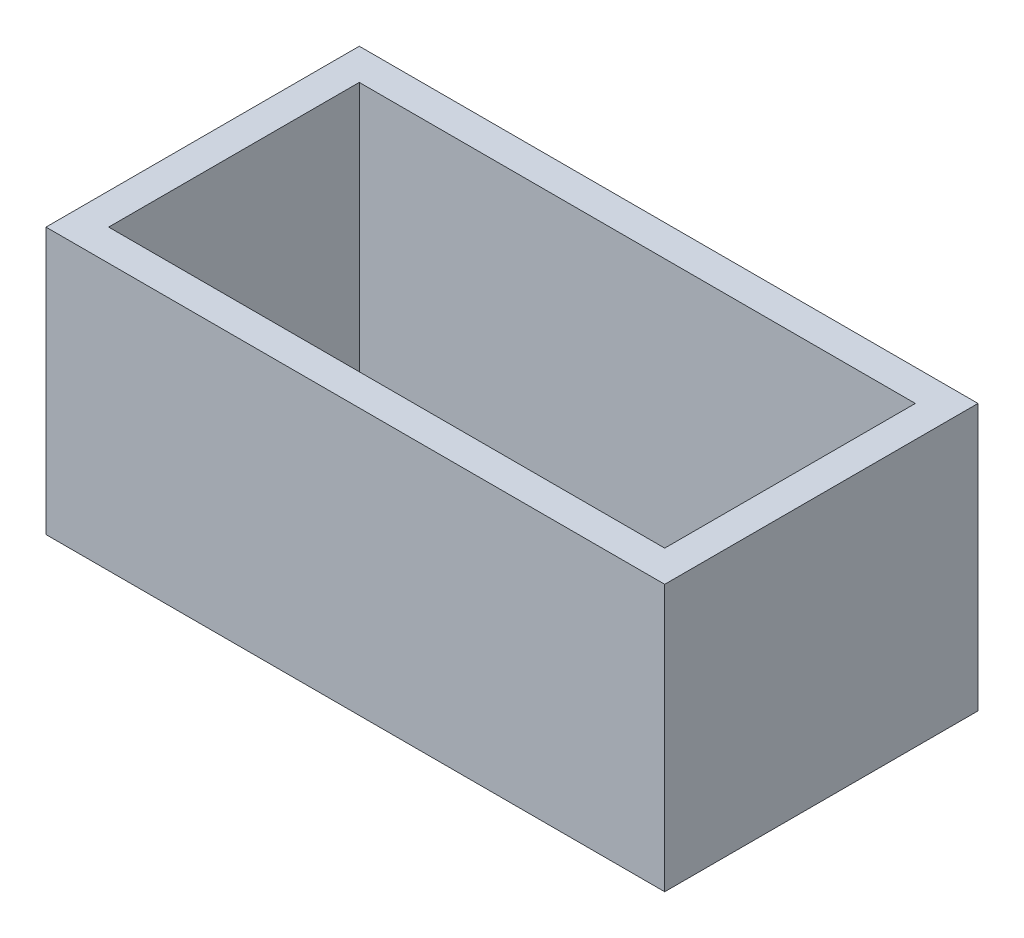
ISO-10303-21;
HEADER;
FILE_DESCRIPTION(('STEP AP214'),'2;1');
FILE_NAME('part.step','',(''),(''),'','','');
FILE_SCHEMA(('AUTOMOTIVE_DESIGN { 1 0 10303 214 1 1 1 1 }'));
ENDSEC;
DATA;
#1=APPLICATION_CONTEXT('core data for automotive mechanical design processes');
#2=APPLICATION_PROTOCOL_DEFINITION('international standard','automotive_design',2000,#1);
#3=PRODUCT_CONTEXT('',#1,'mechanical');
#4=PRODUCT('Part','Part','',(#3));
#5=PRODUCT_RELATED_PRODUCT_CATEGORY('part','',(#4));
#6=PRODUCT_DEFINITION_FORMATION('','',#4);
#7=PRODUCT_DEFINITION_CONTEXT('part definition',#1,'design');
#8=PRODUCT_DEFINITION('design','',#6,#7);
#9=PRODUCT_DEFINITION_SHAPE('','',#8);
#10=(LENGTH_UNIT() NAMED_UNIT(*) SI_UNIT(.MILLI.,.METRE.));
#11=(NAMED_UNIT(*) PLANE_ANGLE_UNIT() SI_UNIT($,.RADIAN.));
#12=(NAMED_UNIT(*) SI_UNIT($,.STERADIAN.) SOLID_ANGLE_UNIT());
#13=UNCERTAINTY_MEASURE_WITH_UNIT(LENGTH_MEASURE(1.E-05),#10,'distance_accuracy_value','');
#14=(GEOMETRIC_REPRESENTATION_CONTEXT(3) GLOBAL_UNCERTAINTY_ASSIGNED_CONTEXT((#13)) GLOBAL_UNIT_ASSIGNED_CONTEXT((#10,
#11,#12)) REPRESENTATION_CONTEXT('',''));
#15=CARTESIAN_POINT('',(0.,0.,0.));
#16=DIRECTION('',(0.,0.,1.));
#17=DIRECTION('',(1.,0.,0.));
#18=AXIS2_PLACEMENT_3D('',#15,#16,#17);
#19=CARTESIAN_POINT('',(0.,17.,0.));
#20=DIRECTION('',(0.,-1.,0.));
#21=DIRECTION('',(0.,0.,-1.));
#22=AXIS2_PLACEMENT_3D('',#19,#20,#21);
#23=PLANE('',#22);
#24=DIRECTION('',(1.,0.,0.));
#25=VECTOR('',#24,1.);
#26=CARTESIAN_POINT('',(19.75,17.,10.));
#27=LINE('',#26,#25);
#28=CARTESIAN_POINT('',(-19.75,17.,10.));
#29=VERTEX_POINT('',#28);
#30=CARTESIAN_POINT('',(19.75,17.,10.));
#31=VERTEX_POINT('',#30);
#32=EDGE_CURVE('E134',#29,#31,#27,.T.);
#33=ORIENTED_EDGE('',*,*,#32,.T.);
#34=DIRECTION('',(0.,0.,-1.));
#35=VECTOR('',#34,1.);
#36=CARTESIAN_POINT('',(19.75,17.,10.));
#37=LINE('',#36,#35);
#38=CARTESIAN_POINT('',(19.75,17.,-10.));
#39=VERTEX_POINT('',#38);
#40=EDGE_CURVE('E137',#31,#39,#37,.T.);
#41=ORIENTED_EDGE('',*,*,#40,.T.);
#42=DIRECTION('',(-1.,0.,0.));
#43=VECTOR('',#42,1.);
#44=CARTESIAN_POINT('',(19.75,17.,-10.));
#45=LINE('',#44,#43);
#46=CARTESIAN_POINT('',(-19.75,17.,-10.));
#47=VERTEX_POINT('',#46);
#48=EDGE_CURVE('E140',#39,#47,#45,.T.);
#49=ORIENTED_EDGE('',*,*,#48,.T.);
#50=DIRECTION('',(0.,0.,1.));
#51=VECTOR('',#50,1.);
#52=CARTESIAN_POINT('',(-19.75,17.,10.));
#53=LINE('',#52,#51);
#54=EDGE_CURVE('E142',#47,#29,#53,.T.);
#55=ORIENTED_EDGE('',*,*,#54,.T.);
#56=EDGE_LOOP('',(#33,#41,#49,#55));
#57=FACE_BOUND('',#56,.T.);
#58=DIRECTION('',(0.,0.,1.));
#59=VECTOR('',#58,1.);
#60=CARTESIAN_POINT('',(-17.75,17.,8.));
#61=LINE('',#60,#59);
#62=CARTESIAN_POINT('',(-17.75,17.,-8.));
#63=VERTEX_POINT('',#62);
#64=CARTESIAN_POINT('',(-17.75,17.,8.));
#65=VERTEX_POINT('',#64);
#66=EDGE_CURVE('E98',#63,#65,#61,.T.);
#67=ORIENTED_EDGE('',*,*,#66,.F.);
#68=DIRECTION('',(-1.,0.,0.));
#69=VECTOR('',#68,1.);
#70=CARTESIAN_POINT('',(17.75,17.,-8.));
#71=LINE('',#70,#69);
#72=CARTESIAN_POINT('',(17.75,17.,-8.));
#73=VERTEX_POINT('',#72);
#74=EDGE_CURVE('E120',#73,#63,#71,.T.);
#75=ORIENTED_EDGE('',*,*,#74,.F.);
#76=DIRECTION('',(0.,0.,-1.));
#77=VECTOR('',#76,1.);
#78=CARTESIAN_POINT('',(17.75,17.,8.));
#79=LINE('',#78,#77);
#80=CARTESIAN_POINT('',(17.75,17.,8.));
#81=VERTEX_POINT('',#80);
#82=EDGE_CURVE('E118',#81,#73,#79,.T.);
#83=ORIENTED_EDGE('',*,*,#82,.F.);
#84=DIRECTION('',(1.,0.,0.));
#85=VECTOR('',#84,1.);
#86=CARTESIAN_POINT('',(17.75,17.,8.));
#87=LINE('',#86,#85);
#88=EDGE_CURVE('E106',#65,#81,#87,.T.);
#89=ORIENTED_EDGE('',*,*,#88,.F.);
#90=EDGE_LOOP('',(#67,#75,#83,#89));
#91=FACE_BOUND('',#90,.T.);
#92=ADVANCED_FACE('F33',(#57,#91),#23,.F.);
#93=CARTESIAN_POINT('',(0.,0.,0.));
#94=DIRECTION('',(0.,-1.,0.));
#95=DIRECTION('',(0.,0.,-1.));
#96=AXIS2_PLACEMENT_3D('',#93,#94,#95);
#97=PLANE('',#96);
#98=DIRECTION('',(1.,0.,0.));
#99=VECTOR('',#98,1.);
#100=CARTESIAN_POINT('',(19.75,0.,10.));
#101=LINE('',#100,#99);
#102=CARTESIAN_POINT('',(-19.75,0.,10.));
#103=VERTEX_POINT('',#102);
#104=CARTESIAN_POINT('',(19.75,0.,10.));
#105=VERTEX_POINT('',#104);
#106=EDGE_CURVE('E114',#103,#105,#101,.T.);
#107=ORIENTED_EDGE('',*,*,#106,.F.);
#108=DIRECTION('',(0.,0.,1.));
#109=VECTOR('',#108,1.);
#110=CARTESIAN_POINT('',(-19.75,0.,10.));
#111=LINE('',#110,#109);
#112=CARTESIAN_POINT('',(-19.75,0.,-10.));
#113=VERTEX_POINT('',#112);
#114=EDGE_CURVE('E138',#113,#103,#111,.T.);
#115=ORIENTED_EDGE('',*,*,#114,.F.);
#116=DIRECTION('',(-1.,0.,0.));
#117=VECTOR('',#116,1.);
#118=CARTESIAN_POINT('',(19.75,0.,-10.));
#119=LINE('',#118,#117);
#120=CARTESIAN_POINT('',(19.75,0.,-10.));
#121=VERTEX_POINT('',#120);
#122=EDGE_CURVE('E149',#121,#113,#119,.T.);
#123=ORIENTED_EDGE('',*,*,#122,.F.);
#124=DIRECTION('',(0.,0.,-1.));
#125=VECTOR('',#124,1.);
#126=CARTESIAN_POINT('',(19.75,0.,10.));
#127=LINE('',#126,#125);
#128=EDGE_CURVE('E147',#105,#121,#127,.T.);
#129=ORIENTED_EDGE('',*,*,#128,.F.);
#130=EDGE_LOOP('',(#107,#115,#123,#129));
#131=FACE_BOUND('',#130,.T.);
#132=DIRECTION('',(-1.,0.,0.));
#133=VECTOR('',#132,1.);
#134=CARTESIAN_POINT('',(17.75,0.,-8.));
#135=LINE('',#134,#133);
#136=CARTESIAN_POINT('',(17.75,0.,-8.));
#137=VERTEX_POINT('',#136);
#138=CARTESIAN_POINT('',(-17.75,0.,-8.));
#139=VERTEX_POINT('',#138);
#140=EDGE_CURVE('E107',#137,#139,#135,.T.);
#141=ORIENTED_EDGE('',*,*,#140,.T.);
#142=DIRECTION('',(0.,0.,1.));
#143=VECTOR('',#142,1.);
#144=CARTESIAN_POINT('',(-17.75,0.,8.));
#145=LINE('',#144,#143);
#146=CARTESIAN_POINT('',(-17.75,0.,8.));
#147=VERTEX_POINT('',#146);
#148=EDGE_CURVE('E56',#139,#147,#145,.T.);
#149=ORIENTED_EDGE('',*,*,#148,.T.);
#150=DIRECTION('',(1.,0.,0.));
#151=VECTOR('',#150,1.);
#152=CARTESIAN_POINT('',(17.75,0.,8.));
#153=LINE('',#152,#151);
#154=CARTESIAN_POINT('',(17.75,0.,8.));
#155=VERTEX_POINT('',#154);
#156=EDGE_CURVE('E113',#147,#155,#153,.T.);
#157=ORIENTED_EDGE('',*,*,#156,.T.);
#158=DIRECTION('',(0.,0.,-1.));
#159=VECTOR('',#158,1.);
#160=CARTESIAN_POINT('',(17.75,0.,8.));
#161=LINE('',#160,#159);
#162=EDGE_CURVE('E126',#155,#137,#161,.T.);
#163=ORIENTED_EDGE('',*,*,#162,.T.);
#164=EDGE_LOOP('',(#141,#149,#157,#163));
#165=FACE_BOUND('',#164,.T.);
#166=ADVANCED_FACE('F167',(#131,#165),#97,.T.);
#167=CARTESIAN_POINT('',(19.75,17.,10.));
#168=DIRECTION('',(0.,0.,-1.));
#169=DIRECTION('',(-1.,0.,0.));
#170=AXIS2_PLACEMENT_3D('',#167,#168,#169);
#171=PLANE('',#170);
#172=ORIENTED_EDGE('',*,*,#106,.T.);
#173=DIRECTION('',(0.,-1.,0.));
#174=VECTOR('',#173,1.);
#175=CARTESIAN_POINT('',(19.75,17.,10.));
#176=LINE('',#175,#174);
#177=EDGE_CURVE('E11',#31,#105,#176,.T.);
#178=ORIENTED_EDGE('',*,*,#177,.F.);
#179=ORIENTED_EDGE('',*,*,#32,.F.);
#180=DIRECTION('',(0.,-1.,0.));
#181=VECTOR('',#180,1.);
#182=CARTESIAN_POINT('',(-19.75,17.,10.));
#183=LINE('',#182,#181);
#184=EDGE_CURVE('E144',#29,#103,#183,.T.);
#185=ORIENTED_EDGE('',*,*,#184,.T.);
#186=EDGE_LOOP('',(#172,#178,#179,#185));
#187=FACE_BOUND('',#186,.T.);
#188=ADVANCED_FACE('F35',(#187),#171,.F.);
#189=CARTESIAN_POINT('',(19.75,17.,10.));
#190=DIRECTION('',(-1.,0.,0.));
#191=DIRECTION('',(0.,0.,1.));
#192=AXIS2_PLACEMENT_3D('',#189,#190,#191);
#193=PLANE('',#192);
#194=ORIENTED_EDGE('',*,*,#128,.T.);
#195=DIRECTION('',(0.,-1.,0.));
#196=VECTOR('',#195,1.);
#197=CARTESIAN_POINT('',(19.75,17.,-10.));
#198=LINE('',#197,#196);
#199=EDGE_CURVE('E41',#39,#121,#198,.T.);
#200=ORIENTED_EDGE('',*,*,#199,.F.);
#201=ORIENTED_EDGE('',*,*,#40,.F.);
#202=ORIENTED_EDGE('',*,*,#177,.T.);
#203=EDGE_LOOP('',(#194,#200,#201,#202));
#204=FACE_BOUND('',#203,.T.);
#205=ADVANCED_FACE('F177',(#204),#193,.F.);
#206=CARTESIAN_POINT('',(19.75,17.,-10.));
#207=DIRECTION('',(0.,0.,1.));
#208=DIRECTION('',(1.,0.,0.));
#209=AXIS2_PLACEMENT_3D('',#206,#207,#208);
#210=PLANE('',#209);
#211=ORIENTED_EDGE('',*,*,#122,.T.);
#212=DIRECTION('',(0.,-1.,0.));
#213=VECTOR('',#212,1.);
#214=CARTESIAN_POINT('',(-19.75,17.,-10.));
#215=LINE('',#214,#213);
#216=EDGE_CURVE('E154',#47,#113,#215,.T.);
#217=ORIENTED_EDGE('',*,*,#216,.F.);
#218=ORIENTED_EDGE('',*,*,#48,.F.);
#219=ORIENTED_EDGE('',*,*,#199,.T.);
#220=EDGE_LOOP('',(#211,#217,#218,#219));
#221=FACE_BOUND('',#220,.T.);
#222=ADVANCED_FACE('F161',(#221),#210,.F.);
#223=CARTESIAN_POINT('',(-19.75,17.,10.));
#224=DIRECTION('',(1.,0.,0.));
#225=DIRECTION('',(0.,0.,-1.));
#226=AXIS2_PLACEMENT_3D('',#223,#224,#225);
#227=PLANE('',#226);
#228=ORIENTED_EDGE('',*,*,#114,.T.);
#229=ORIENTED_EDGE('',*,*,#184,.F.);
#230=ORIENTED_EDGE('',*,*,#54,.F.);
#231=ORIENTED_EDGE('',*,*,#216,.T.);
#232=EDGE_LOOP('',(#228,#229,#230,#231));
#233=FACE_BOUND('',#232,.T.);
#234=ADVANCED_FACE('F171',(#233),#227,.F.);
#235=CARTESIAN_POINT('',(-17.75,17.,8.));
#236=DIRECTION('',(1.,0.,0.));
#237=DIRECTION('',(0.,0.,-1.));
#238=AXIS2_PLACEMENT_3D('',#235,#236,#237);
#239=PLANE('',#238);
#240=ORIENTED_EDGE('',*,*,#148,.F.);
#241=DIRECTION('',(0.,-1.,0.));
#242=VECTOR('',#241,1.);
#243=CARTESIAN_POINT('',(-17.75,17.,-8.));
#244=LINE('',#243,#242);
#245=EDGE_CURVE('E102',#63,#139,#244,.T.);
#246=ORIENTED_EDGE('',*,*,#245,.F.);
#247=ORIENTED_EDGE('',*,*,#66,.T.);
#248=DIRECTION('',(0.,-1.,0.));
#249=VECTOR('',#248,1.);
#250=CARTESIAN_POINT('',(-17.75,17.,8.));
#251=LINE('',#250,#249);
#252=EDGE_CURVE('E101',#65,#147,#251,.T.);
#253=ORIENTED_EDGE('',*,*,#252,.T.);
#254=EDGE_LOOP('',(#240,#246,#247,#253));
#255=FACE_BOUND('',#254,.T.);
#256=ADVANCED_FACE('F100',(#255),#239,.T.);
#257=CARTESIAN_POINT('',(17.75,17.,8.));
#258=DIRECTION('',(0.,0.,-1.));
#259=DIRECTION('',(-1.,0.,0.));
#260=AXIS2_PLACEMENT_3D('',#257,#258,#259);
#261=PLANE('',#260);
#262=ORIENTED_EDGE('',*,*,#156,.F.);
#263=ORIENTED_EDGE('',*,*,#252,.F.);
#264=ORIENTED_EDGE('',*,*,#88,.T.);
#265=DIRECTION('',(0.,-1.,0.));
#266=VECTOR('',#265,1.);
#267=CARTESIAN_POINT('',(17.75,17.,8.));
#268=LINE('',#267,#266);
#269=EDGE_CURVE('E115',#81,#155,#268,.T.);
#270=ORIENTED_EDGE('',*,*,#269,.T.);
#271=EDGE_LOOP('',(#262,#263,#264,#270));
#272=FACE_BOUND('',#271,.T.);
#273=ADVANCED_FACE('F110',(#272),#261,.T.);
#274=CARTESIAN_POINT('',(17.75,17.,8.));
#275=DIRECTION('',(-1.,0.,0.));
#276=DIRECTION('',(0.,0.,1.));
#277=AXIS2_PLACEMENT_3D('',#274,#275,#276);
#278=PLANE('',#277);
#279=ORIENTED_EDGE('',*,*,#162,.F.);
#280=ORIENTED_EDGE('',*,*,#269,.F.);
#281=ORIENTED_EDGE('',*,*,#82,.T.);
#282=DIRECTION('',(0.,-1.,0.));
#283=VECTOR('',#282,1.);
#284=CARTESIAN_POINT('',(17.75,17.,-8.));
#285=LINE('',#284,#283);
#286=EDGE_CURVE('E48',#73,#137,#285,.T.);
#287=ORIENTED_EDGE('',*,*,#286,.T.);
#288=EDGE_LOOP('',(#279,#280,#281,#287));
#289=FACE_BOUND('',#288,.T.);
#290=ADVANCED_FACE('F200',(#289),#278,.T.);
#291=CARTESIAN_POINT('',(17.75,17.,-8.));
#292=DIRECTION('',(0.,0.,1.));
#293=DIRECTION('',(1.,0.,0.));
#294=AXIS2_PLACEMENT_3D('',#291,#292,#293);
#295=PLANE('',#294);
#296=ORIENTED_EDGE('',*,*,#140,.F.);
#297=ORIENTED_EDGE('',*,*,#286,.F.);
#298=ORIENTED_EDGE('',*,*,#74,.T.);
#299=ORIENTED_EDGE('',*,*,#245,.T.);
#300=EDGE_LOOP('',(#296,#297,#298,#299));
#301=FACE_BOUND('',#300,.T.);
#302=ADVANCED_FACE('F204',(#301),#295,.T.);
#303=CLOSED_SHELL('',(#92,#166,#188,#205,#222,#234,#256,#273,#290,#302));
#304=MANIFOLD_SOLID_BREP('B2',#303);
#305=ADVANCED_BREP_SHAPE_REPRESENTATION('',(#18,#304),#14);
#306=SHAPE_DEFINITION_REPRESENTATION(#9,#305);
ENDSEC;
END-ISO-10303-21;
